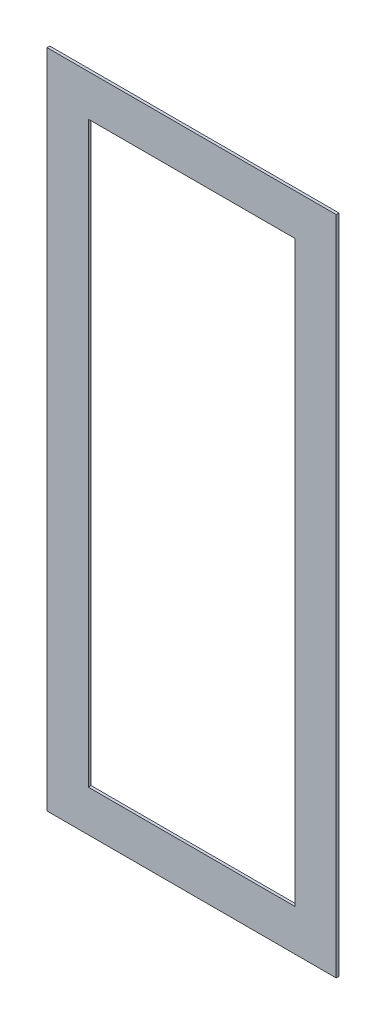
ISO-10303-21;
HEADER;
FILE_DESCRIPTION(('STEP AP214'),'2;1');
FILE_NAME('part.step','',(''),(''),'','','');
FILE_SCHEMA(('AUTOMOTIVE_DESIGN { 1 0 10303 214 1 1 1 1 }'));
ENDSEC;
DATA;
#1=APPLICATION_CONTEXT('core data for automotive mechanical design processes');
#2=APPLICATION_PROTOCOL_DEFINITION('international standard','automotive_design',2000,#1);
#3=PRODUCT_CONTEXT('',#1,'mechanical');
#4=PRODUCT('Part','Part','',(#3));
#5=PRODUCT_RELATED_PRODUCT_CATEGORY('part','',(#4));
#6=PRODUCT_DEFINITION_FORMATION('','',#4);
#7=PRODUCT_DEFINITION_CONTEXT('part definition',#1,'design');
#8=PRODUCT_DEFINITION('design','',#6,#7);
#9=PRODUCT_DEFINITION_SHAPE('','',#8);
#10=(LENGTH_UNIT() NAMED_UNIT(*) SI_UNIT(.MILLI.,.METRE.));
#11=(NAMED_UNIT(*) PLANE_ANGLE_UNIT() SI_UNIT($,.RADIAN.));
#12=(NAMED_UNIT(*) SI_UNIT($,.STERADIAN.) SOLID_ANGLE_UNIT());
#13=UNCERTAINTY_MEASURE_WITH_UNIT(LENGTH_MEASURE(1.E-05),#10,'distance_accuracy_value','');
#14=(GEOMETRIC_REPRESENTATION_CONTEXT(3) GLOBAL_UNCERTAINTY_ASSIGNED_CONTEXT((#13)) GLOBAL_UNIT_ASSIGNED_CONTEXT((#10,
#11,#12)) REPRESENTATION_CONTEXT('',''));
#15=CARTESIAN_POINT('',(0.,0.,0.));
#16=DIRECTION('',(0.,0.,1.));
#17=DIRECTION('',(1.,0.,0.));
#18=AXIS2_PLACEMENT_3D('',#15,#16,#17);
#19=CARTESIAN_POINT('',(0.,0.,0.2));
#20=DIRECTION('',(0.,0.,-1.));
#21=DIRECTION('',(-1.,0.,0.));
#22=AXIS2_PLACEMENT_3D('',#19,#20,#21);
#23=PLANE('',#22);
#24=DIRECTION('',(0.,1.,0.));
#25=VECTOR('',#24,1.);
#26=CARTESIAN_POINT('',(10.5,24.,0.2));
#27=LINE('',#26,#25);
#28=CARTESIAN_POINT('',(10.5,-24.,0.2));
#29=VERTEX_POINT('',#28);
#30=CARTESIAN_POINT('',(10.5,24.,0.2));
#31=VERTEX_POINT('',#30);
#32=EDGE_CURVE('E133',#29,#31,#27,.T.);
#33=ORIENTED_EDGE('',*,*,#32,.T.);
#34=DIRECTION('',(-1.,0.,0.));
#35=VECTOR('',#34,1.);
#36=CARTESIAN_POINT('',(10.5,24.,0.2));
#37=LINE('',#36,#35);
#38=CARTESIAN_POINT('',(-10.5,24.,0.2));
#39=VERTEX_POINT('',#38);
#40=EDGE_CURVE('E136',#31,#39,#37,.T.);
#41=ORIENTED_EDGE('',*,*,#40,.T.);
#42=DIRECTION('',(0.,-1.,0.));
#43=VECTOR('',#42,1.);
#44=CARTESIAN_POINT('',(-10.5,24.,0.2));
#45=LINE('',#44,#43);
#46=CARTESIAN_POINT('',(-10.5,-24.,0.2));
#47=VERTEX_POINT('',#46);
#48=EDGE_CURVE('E139',#39,#47,#45,.T.);
#49=ORIENTED_EDGE('',*,*,#48,.T.);
#50=DIRECTION('',(1.,0.,0.));
#51=VECTOR('',#50,1.);
#52=CARTESIAN_POINT('',(10.5,-24.,0.2));
#53=LINE('',#52,#51);
#54=EDGE_CURVE('E141',#47,#29,#53,.T.);
#55=ORIENTED_EDGE('',*,*,#54,.T.);
#56=EDGE_LOOP('',(#33,#41,#49,#55));
#57=FACE_BOUND('',#56,.T.);
#58=DIRECTION('',(0.,-1.,0.));
#59=VECTOR('',#58,1.);
#60=CARTESIAN_POINT('',(-7.50000000000001,21.,0.2));
#61=LINE('',#60,#59);
#62=CARTESIAN_POINT('',(-7.50000000000001,21.,0.2));
#63=VERTEX_POINT('',#62);
#64=CARTESIAN_POINT('',(-7.5,-21.,0.2));
#65=VERTEX_POINT('',#64);
#66=EDGE_CURVE('E97',#63,#65,#61,.T.);
#67=ORIENTED_EDGE('',*,*,#66,.F.);
#68=DIRECTION('',(-1.,0.,0.));
#69=VECTOR('',#68,1.);
#70=CARTESIAN_POINT('',(7.49999999999999,21.,0.2));
#71=LINE('',#70,#69);
#72=CARTESIAN_POINT('',(7.49999999999999,21.,0.2));
#73=VERTEX_POINT('',#72);
#74=EDGE_CURVE('E119',#73,#63,#71,.T.);
#75=ORIENTED_EDGE('',*,*,#74,.F.);
#76=DIRECTION('',(0.,1.,0.));
#77=VECTOR('',#76,1.);
#78=CARTESIAN_POINT('',(7.49999999999999,21.,0.2));
#79=LINE('',#78,#77);
#80=CARTESIAN_POINT('',(7.5,-21.,0.2));
#81=VERTEX_POINT('',#80);
#82=EDGE_CURVE('E117',#81,#73,#79,.T.);
#83=ORIENTED_EDGE('',*,*,#82,.F.);
#84=DIRECTION('',(1.,0.,0.));
#85=VECTOR('',#84,1.);
#86=CARTESIAN_POINT('',(7.5,-21.,0.2));
#87=LINE('',#86,#85);
#88=EDGE_CURVE('E105',#65,#81,#87,.T.);
#89=ORIENTED_EDGE('',*,*,#88,.F.);
#90=EDGE_LOOP('',(#67,#75,#83,#89));
#91=FACE_BOUND('',#90,.T.);
#92=ADVANCED_FACE('F32',(#57,#91),#23,.F.);
#93=CARTESIAN_POINT('',(0.,0.,0.));
#94=DIRECTION('',(0.,0.,-1.));
#95=DIRECTION('',(-1.,0.,0.));
#96=AXIS2_PLACEMENT_3D('',#93,#94,#95);
#97=PLANE('',#96);
#98=DIRECTION('',(0.,1.,0.));
#99=VECTOR('',#98,1.);
#100=CARTESIAN_POINT('',(10.5,24.,0.));
#101=LINE('',#100,#99);
#102=CARTESIAN_POINT('',(10.5,-24.,0.));
#103=VERTEX_POINT('',#102);
#104=CARTESIAN_POINT('',(10.5,24.,0.));
#105=VERTEX_POINT('',#104);
#106=EDGE_CURVE('E113',#103,#105,#101,.T.);
#107=ORIENTED_EDGE('',*,*,#106,.F.);
#108=DIRECTION('',(1.,0.,0.));
#109=VECTOR('',#108,1.);
#110=CARTESIAN_POINT('',(10.5,-24.,0.));
#111=LINE('',#110,#109);
#112=CARTESIAN_POINT('',(-10.5,-24.,0.));
#113=VERTEX_POINT('',#112);
#114=EDGE_CURVE('E137',#113,#103,#111,.T.);
#115=ORIENTED_EDGE('',*,*,#114,.F.);
#116=DIRECTION('',(0.,-1.,0.));
#117=VECTOR('',#116,1.);
#118=CARTESIAN_POINT('',(-10.5,24.,0.));
#119=LINE('',#118,#117);
#120=CARTESIAN_POINT('',(-10.5,24.,0.));
#121=VERTEX_POINT('',#120);
#122=EDGE_CURVE('E148',#121,#113,#119,.T.);
#123=ORIENTED_EDGE('',*,*,#122,.F.);
#124=DIRECTION('',(-1.,0.,0.));
#125=VECTOR('',#124,1.);
#126=CARTESIAN_POINT('',(10.5,24.,0.));
#127=LINE('',#126,#125);
#128=EDGE_CURVE('E146',#105,#121,#127,.T.);
#129=ORIENTED_EDGE('',*,*,#128,.F.);
#130=EDGE_LOOP('',(#107,#115,#123,#129));
#131=FACE_BOUND('',#130,.T.);
#132=DIRECTION('',(-1.,0.,0.));
#133=VECTOR('',#132,1.);
#134=CARTESIAN_POINT('',(7.49999999999999,21.,0.));
#135=LINE('',#134,#133);
#136=CARTESIAN_POINT('',(7.49999999999999,21.,0.));
#137=VERTEX_POINT('',#136);
#138=CARTESIAN_POINT('',(-7.50000000000001,21.,0.));
#139=VERTEX_POINT('',#138);
#140=EDGE_CURVE('E106',#137,#139,#135,.T.);
#141=ORIENTED_EDGE('',*,*,#140,.T.);
#142=DIRECTION('',(0.,-1.,0.));
#143=VECTOR('',#142,1.);
#144=CARTESIAN_POINT('',(-7.50000000000001,21.,0.));
#145=LINE('',#144,#143);
#146=CARTESIAN_POINT('',(-7.5,-21.,0.));
#147=VERTEX_POINT('',#146);
#148=EDGE_CURVE('E55',#139,#147,#145,.T.);
#149=ORIENTED_EDGE('',*,*,#148,.T.);
#150=DIRECTION('',(1.,0.,0.));
#151=VECTOR('',#150,1.);
#152=CARTESIAN_POINT('',(7.5,-21.,0.));
#153=LINE('',#152,#151);
#154=CARTESIAN_POINT('',(7.5,-21.,0.));
#155=VERTEX_POINT('',#154);
#156=EDGE_CURVE('E112',#147,#155,#153,.T.);
#157=ORIENTED_EDGE('',*,*,#156,.T.);
#158=DIRECTION('',(0.,1.,0.));
#159=VECTOR('',#158,1.);
#160=CARTESIAN_POINT('',(7.49999999999999,21.,0.));
#161=LINE('',#160,#159);
#162=EDGE_CURVE('E125',#155,#137,#161,.T.);
#163=ORIENTED_EDGE('',*,*,#162,.T.);
#164=EDGE_LOOP('',(#141,#149,#157,#163));
#165=FACE_BOUND('',#164,.T.);
#166=ADVANCED_FACE('F166',(#131,#165),#97,.T.);
#167=CARTESIAN_POINT('',(10.5,24.,0.2));
#168=DIRECTION('',(-1.,0.,0.));
#169=DIRECTION('',(0.,-1.,0.));
#170=AXIS2_PLACEMENT_3D('',#167,#168,#169);
#171=PLANE('',#170);
#172=ORIENTED_EDGE('',*,*,#106,.T.);
#173=DIRECTION('',(0.,0.,-1.));
#174=VECTOR('',#173,1.);
#175=CARTESIAN_POINT('',(10.5,24.,0.2));
#176=LINE('',#175,#174);
#177=EDGE_CURVE('E11',#31,#105,#176,.T.);
#178=ORIENTED_EDGE('',*,*,#177,.F.);
#179=ORIENTED_EDGE('',*,*,#32,.F.);
#180=DIRECTION('',(0.,0.,-1.));
#181=VECTOR('',#180,1.);
#182=CARTESIAN_POINT('',(10.5,-24.,0.2));
#183=LINE('',#182,#181);
#184=EDGE_CURVE('E143',#29,#103,#183,.T.);
#185=ORIENTED_EDGE('',*,*,#184,.T.);
#186=EDGE_LOOP('',(#172,#178,#179,#185));
#187=FACE_BOUND('',#186,.T.);
#188=ADVANCED_FACE('F34',(#187),#171,.F.);
#189=CARTESIAN_POINT('',(10.5,24.,0.2));
#190=DIRECTION('',(0.,-1.,0.));
#191=DIRECTION('',(1.,0.,0.));
#192=AXIS2_PLACEMENT_3D('',#189,#190,#191);
#193=PLANE('',#192);
#194=ORIENTED_EDGE('',*,*,#128,.T.);
#195=DIRECTION('',(0.,0.,-1.));
#196=VECTOR('',#195,1.);
#197=CARTESIAN_POINT('',(-10.5,24.,0.2));
#198=LINE('',#197,#196);
#199=EDGE_CURVE('E40',#39,#121,#198,.T.);
#200=ORIENTED_EDGE('',*,*,#199,.F.);
#201=ORIENTED_EDGE('',*,*,#40,.F.);
#202=ORIENTED_EDGE('',*,*,#177,.T.);
#203=EDGE_LOOP('',(#194,#200,#201,#202));
#204=FACE_BOUND('',#203,.T.);
#205=ADVANCED_FACE('F176',(#204),#193,.F.);
#206=CARTESIAN_POINT('',(-10.5,24.,0.2));
#207=DIRECTION('',(1.,0.,0.));
#208=DIRECTION('',(0.,1.,0.));
#209=AXIS2_PLACEMENT_3D('',#206,#207,#208);
#210=PLANE('',#209);
#211=ORIENTED_EDGE('',*,*,#122,.T.);
#212=DIRECTION('',(0.,0.,-1.));
#213=VECTOR('',#212,1.);
#214=CARTESIAN_POINT('',(-10.5,-24.,0.2));
#215=LINE('',#214,#213);
#216=EDGE_CURVE('E153',#47,#113,#215,.T.);
#217=ORIENTED_EDGE('',*,*,#216,.F.);
#218=ORIENTED_EDGE('',*,*,#48,.F.);
#219=ORIENTED_EDGE('',*,*,#199,.T.);
#220=EDGE_LOOP('',(#211,#217,#218,#219));
#221=FACE_BOUND('',#220,.T.);
#222=ADVANCED_FACE('F160',(#221),#210,.F.);
#223=CARTESIAN_POINT('',(10.5,-24.,0.2));
#224=DIRECTION('',(0.,1.,0.));
#225=DIRECTION('',(0.,0.,1.));
#226=AXIS2_PLACEMENT_3D('',#223,#224,#225);
#227=PLANE('',#226);
#228=ORIENTED_EDGE('',*,*,#114,.T.);
#229=ORIENTED_EDGE('',*,*,#184,.F.);
#230=ORIENTED_EDGE('',*,*,#54,.F.);
#231=ORIENTED_EDGE('',*,*,#216,.T.);
#232=EDGE_LOOP('',(#228,#229,#230,#231));
#233=FACE_BOUND('',#232,.T.);
#234=ADVANCED_FACE('F170',(#233),#227,.F.);
#235=CARTESIAN_POINT('',(-7.50000000000001,21.,0.2));
#236=DIRECTION('',(1.,0.,0.));
#237=DIRECTION('',(0.,1.,0.));
#238=AXIS2_PLACEMENT_3D('',#235,#236,#237);
#239=PLANE('',#238);
#240=ORIENTED_EDGE('',*,*,#148,.F.);
#241=DIRECTION('',(0.,0.,-1.));
#242=VECTOR('',#241,1.);
#243=CARTESIAN_POINT('',(-7.50000000000001,21.,0.2));
#244=LINE('',#243,#242);
#245=EDGE_CURVE('E101',#63,#139,#244,.T.);
#246=ORIENTED_EDGE('',*,*,#245,.F.);
#247=ORIENTED_EDGE('',*,*,#66,.T.);
#248=DIRECTION('',(0.,0.,-1.));
#249=VECTOR('',#248,1.);
#250=CARTESIAN_POINT('',(-7.5,-21.,0.2));
#251=LINE('',#250,#249);
#252=EDGE_CURVE('E100',#65,#147,#251,.T.);
#253=ORIENTED_EDGE('',*,*,#252,.T.);
#254=EDGE_LOOP('',(#240,#246,#247,#253));
#255=FACE_BOUND('',#254,.T.);
#256=ADVANCED_FACE('F99',(#255),#239,.T.);
#257=CARTESIAN_POINT('',(7.5,-21.,0.2));
#258=DIRECTION('',(0.,1.,0.));
#259=DIRECTION('',(0.,0.,1.));
#260=AXIS2_PLACEMENT_3D('',#257,#258,#259);
#261=PLANE('',#260);
#262=ORIENTED_EDGE('',*,*,#156,.F.);
#263=ORIENTED_EDGE('',*,*,#252,.F.);
#264=ORIENTED_EDGE('',*,*,#88,.T.);
#265=DIRECTION('',(0.,0.,-1.));
#266=VECTOR('',#265,1.);
#267=CARTESIAN_POINT('',(7.5,-21.,0.2));
#268=LINE('',#267,#266);
#269=EDGE_CURVE('E114',#81,#155,#268,.T.);
#270=ORIENTED_EDGE('',*,*,#269,.T.);
#271=EDGE_LOOP('',(#262,#263,#264,#270));
#272=FACE_BOUND('',#271,.T.);
#273=ADVANCED_FACE('F109',(#272),#261,.T.);
#274=CARTESIAN_POINT('',(7.49999999999999,21.,0.2));
#275=DIRECTION('',(-1.,0.,0.));
#276=DIRECTION('',(0.,-1.,0.));
#277=AXIS2_PLACEMENT_3D('',#274,#275,#276);
#278=PLANE('',#277);
#279=ORIENTED_EDGE('',*,*,#162,.F.);
#280=ORIENTED_EDGE('',*,*,#269,.F.);
#281=ORIENTED_EDGE('',*,*,#82,.T.);
#282=DIRECTION('',(0.,0.,-1.));
#283=VECTOR('',#282,1.);
#284=CARTESIAN_POINT('',(7.49999999999999,21.,0.2));
#285=LINE('',#284,#283);
#286=EDGE_CURVE('E47',#73,#137,#285,.T.);
#287=ORIENTED_EDGE('',*,*,#286,.T.);
#288=EDGE_LOOP('',(#279,#280,#281,#287));
#289=FACE_BOUND('',#288,.T.);
#290=ADVANCED_FACE('F199',(#289),#278,.T.);
#291=CARTESIAN_POINT('',(7.49999999999999,21.,0.2));
#292=DIRECTION('',(0.,-1.,0.));
#293=DIRECTION('',(1.,0.,0.));
#294=AXIS2_PLACEMENT_3D('',#291,#292,#293);
#295=PLANE('',#294);
#296=ORIENTED_EDGE('',*,*,#140,.F.);
#297=ORIENTED_EDGE('',*,*,#286,.F.);
#298=ORIENTED_EDGE('',*,*,#74,.T.);
#299=ORIENTED_EDGE('',*,*,#245,.T.);
#300=EDGE_LOOP('',(#296,#297,#298,#299));
#301=FACE_BOUND('',#300,.T.);
#302=ADVANCED_FACE('F203',(#301),#295,.T.);
#303=CLOSED_SHELL('',(#92,#166,#188,#205,#222,#234,#256,#273,#290,#302));
#304=MANIFOLD_SOLID_BREP('B2',#303);
#305=ADVANCED_BREP_SHAPE_REPRESENTATION('',(#18,#304),#14);
#306=SHAPE_DEFINITION_REPRESENTATION(#9,#305);
ENDSEC;
END-ISO-10303-21;
